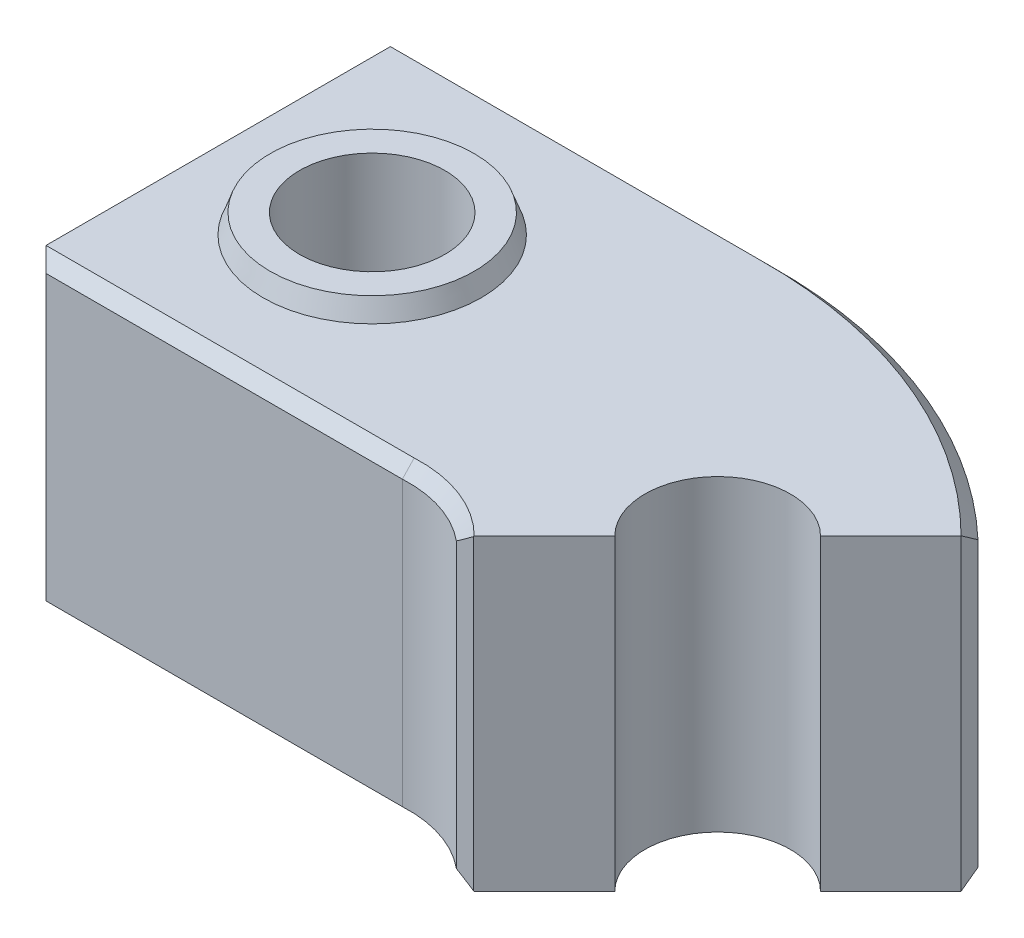
ISO-10303-21;
HEADER;
FILE_DESCRIPTION(('STEP AP214'),'2;1');
FILE_NAME('part.step','',(''),(''),'','','');
FILE_SCHEMA(('AUTOMOTIVE_DESIGN { 1 0 10303 214 1 1 1 1 }'));
ENDSEC;
DATA;
#1=APPLICATION_CONTEXT('core data for automotive mechanical design processes');
#2=APPLICATION_PROTOCOL_DEFINITION('international standard','automotive_design',2000,#1);
#3=PRODUCT_CONTEXT('',#1,'mechanical');
#4=PRODUCT('Part','Part','',(#3));
#5=PRODUCT_RELATED_PRODUCT_CATEGORY('part','',(#4));
#6=PRODUCT_DEFINITION_FORMATION('','',#4);
#7=PRODUCT_DEFINITION_CONTEXT('part definition',#1,'design');
#8=PRODUCT_DEFINITION('design','',#6,#7);
#9=PRODUCT_DEFINITION_SHAPE('','',#8);
#10=(LENGTH_UNIT() NAMED_UNIT(*) SI_UNIT(.MILLI.,.METRE.));
#11=(NAMED_UNIT(*) PLANE_ANGLE_UNIT() SI_UNIT($,.RADIAN.));
#12=(NAMED_UNIT(*) SI_UNIT($,.STERADIAN.) SOLID_ANGLE_UNIT());
#13=UNCERTAINTY_MEASURE_WITH_UNIT(LENGTH_MEASURE(1.E-05),#10,'distance_accuracy_value','');
#14=(GEOMETRIC_REPRESENTATION_CONTEXT(3) GLOBAL_UNCERTAINTY_ASSIGNED_CONTEXT((#13)) GLOBAL_UNIT_ASSIGNED_CONTEXT((#10,
#11,#12)) REPRESENTATION_CONTEXT('',''));
#15=CARTESIAN_POINT('',(0.,0.,0.));
#16=DIRECTION('',(0.,0.,1.));
#17=DIRECTION('',(1.,0.,0.));
#18=AXIS2_PLACEMENT_3D('',#15,#16,#17);
#19=CARTESIAN_POINT('',(-91.1181961206965,-213.,-123.982861888397));
#20=DIRECTION('',(0.,1.,0.));
#21=DIRECTION('',(0.,0.,1.));
#22=AXIS2_PLACEMENT_3D('',#19,#20,#21);
#23=CYLINDRICAL_SURFACE('',#22,30.);
#24=CARTESIAN_POINT('',(-91.1181961206965,8.,-123.982861888397));
#25=DIRECTION('',(0.,1.,0.));
#26=DIRECTION('',(0.,0.,1.));
#27=AXIS2_PLACEMENT_3D('',#24,#25,#26);
#28=CIRCLE('',#27,30.);
#29=CARTESIAN_POINT('',(-91.1181961206965,8.,-93.9828618883967));
#30=VERTEX_POINT('',#29);
#31=EDGE_CURVE('E474',#30,#30,#28,.T.);
#32=ORIENTED_EDGE('',*,*,#31,.T.);
#33=EDGE_LOOP('',(#32));
#34=FACE_BOUND('',#33,.T.);
#35=CARTESIAN_POINT('',(-91.1181961206965,-117.,-123.982861888397));
#36=DIRECTION('',(0.,-1.,0.));
#37=DIRECTION('',(0.,0.,-1.));
#38=AXIS2_PLACEMENT_3D('',#35,#36,#37);
#39=CIRCLE('',#38,30.);
#40=CARTESIAN_POINT('',(-91.1181961206965,-117.,-153.982861888397));
#41=VERTEX_POINT('',#40);
#42=EDGE_CURVE('E472',#41,#41,#39,.F.);
#43=ORIENTED_EDGE('',*,*,#42,.F.);
#44=EDGE_LOOP('',(#43));
#45=FACE_BOUND('',#44,.T.);
#46=ADVANCED_FACE('F35',(#34,#45),#23,.F.);
#47=CARTESIAN_POINT('',(0.,0.,0.));
#48=DIRECTION('',(0.,1.,0.));
#49=DIRECTION('',(0.,0.,1.));
#50=AXIS2_PLACEMENT_3D('',#47,#48,#49);
#51=PLANE('',#50);
#52=DIRECTION('',(-0.707106781186546,0.,0.707106781186549));
#53=VECTOR('',#52,1.);
#54=CARTESIAN_POINT('',(33.9411254969542,0.,-33.9411254969543));
#55=LINE('',#54,#53);
#56=CARTESIAN_POINT('',(137.840487520902,0.,-137.840487520902));
#57=VERTEX_POINT('',#56);
#58=CARTESIAN_POINT('',(108.894444302728,0.,-108.894444302728));
#59=VERTEX_POINT('',#58);
#60=EDGE_CURVE('E149',#57,#59,#55,.T.);
#61=ORIENTED_EDGE('',*,*,#60,.F.);
#62=DIRECTION('',(0.0128215667490054,0.,0.999917800334658));
#63=VECTOR('',#62,1.);
#64=CARTESIAN_POINT('',(139.585013305818,0.,-1.78984568997807));
#65=LINE('',#64,#63);
#66=CARTESIAN_POINT('',(137.839310000962,0.,-137.932318977311));
#67=VERTEX_POINT('',#66);
#68=EDGE_CURVE('E205',#57,#67,#65,.F.);
#69=ORIENTED_EDGE('',*,*,#68,.T.);
#70=CARTESIAN_POINT('',(0.,0.,0.));
#71=DIRECTION('',(0.,1.,0.));
#72=DIRECTION('',(0.,0.,1.));
#73=AXIS2_PLACEMENT_3D('',#70,#71,#72);
#74=CIRCLE('',#73,195.);
#75=CARTESIAN_POINT('',(-2.58526010498195,0.,-194.982861888397));
#76=VERTEX_POINT('',#75);
#77=EDGE_CURVE('E201',#67,#76,#74,.T.);
#78=ORIENTED_EDGE('',*,*,#77,.T.);
#79=DIRECTION('',(-1.,0.,0.));
#80=VECTOR('',#79,1.);
#81=CARTESIAN_POINT('',(-154.618196120696,0.,-194.982861888397));
#82=LINE('',#81,#80);
#83=CARTESIAN_POINT('',(-154.618196120696,0.,-194.982861888397));
#84=VERTEX_POINT('',#83);
#85=EDGE_CURVE('E203',#76,#84,#82,.T.);
#86=ORIENTED_EDGE('',*,*,#85,.T.);
#87=DIRECTION('',(0.,0.,-1.));
#88=VECTOR('',#87,1.);
#89=CARTESIAN_POINT('',(-154.618196120696,0.,-47.928541069738));
#90=LINE('',#89,#88);
#91=CARTESIAN_POINT('',(-154.618196120696,0.,-52.928541069738));
#92=VERTEX_POINT('',#91);
#93=EDGE_CURVE('E184',#92,#84,#90,.T.);
#94=ORIENTED_EDGE('',*,*,#93,.F.);
#95=DIRECTION('',(1.,0.,0.));
#96=VECTOR('',#95,1.);
#97=CARTESIAN_POINT('',(-2.61819612069647,0.,-52.928541069738));
#98=LINE('',#97,#96);
#99=CARTESIAN_POINT('',(-2.75127974387426,0.,-52.928541069738));
#100=VERTEX_POINT('',#99);
#101=EDGE_CURVE('E199',#92,#100,#98,.T.);
#102=ORIENTED_EDGE('',*,*,#101,.T.);
#103=CARTESIAN_POINT('',(0.,0.,0.));
#104=DIRECTION('',(0.,1.,0.));
#105=DIRECTION('',(0.,0.,1.));
#106=AXIS2_PLACEMENT_3D('',#103,#104,#105);
#107=CIRCLE('',#106,52.9999999999999);
#108=CARTESIAN_POINT('',(37.4766594028869,0.,-37.476659402887));
#109=VERTEX_POINT('',#108);
#110=EDGE_CURVE('E197',#100,#109,#107,.F.);
#111=ORIENTED_EDGE('',*,*,#110,.T.);
#112=CARTESIAN_POINT('',(66.4680374315353,0.,-66.4680374315355));
#113=VERTEX_POINT('',#112);
#114=EDGE_CURVE('E159',#113,#109,#55,.T.);
#115=ORIENTED_EDGE('',*,*,#114,.F.);
#116=CARTESIAN_POINT('',(87.6812408671317,0.,-87.681240867132));
#117=DIRECTION('',(0.,1.,0.));
#118=DIRECTION('',(0.,0.,1.));
#119=AXIS2_PLACEMENT_3D('',#116,#117,#118);
#120=CIRCLE('',#119,30.);
#121=EDGE_CURVE('E164',#59,#113,#120,.T.);
#122=ORIENTED_EDGE('',*,*,#121,.F.);
#123=EDGE_LOOP('',(#61,#69,#78,#86,#94,#102,#111,#115,#122));
#124=FACE_BOUND('',#123,.T.);
#125=CARTESIAN_POINT('',(-91.1181961206965,0.,-123.982861888397));
#126=DIRECTION('',(0.,1.,0.));
#127=DIRECTION('',(0.,0.,1.));
#128=AXIS2_PLACEMENT_3D('',#125,#126,#127);
#129=CIRCLE('',#128,45.);
#130=CARTESIAN_POINT('',(-91.1181961206965,0.,-78.9828618883967));
#131=VERTEX_POINT('',#130);
#132=EDGE_CURVE('E462',#131,#131,#129,.T.);
#133=ORIENTED_EDGE('',*,*,#132,.F.);
#134=EDGE_LOOP('',(#133));
#135=FACE_BOUND('',#134,.T.);
#136=ADVANCED_FACE('F172',(#124,#135),#51,.T.);
#137=CARTESIAN_POINT('',(33.9411254969542,-127.,-33.9411254969543));
#138=DIRECTION('',(-0.707106781186549,0.,-0.707106781186546));
#139=DIRECTION('',(-0.707106781186546,0.,0.707106781186549));
#140=AXIS2_PLACEMENT_3D('',#137,#138,#139);
#141=PLANE('',#140);
#142=DIRECTION('',(0.,-1.,0.));
#143=VECTOR('',#142,1.);
#144=CARTESIAN_POINT('',(37.3095162123551,-127.,-37.3095162123553));
#145=LINE('',#144,#143);
#146=CARTESIAN_POINT('',(37.3095162123551,-0.236376166908331,-37.3095162123553));
#147=VERTEX_POINT('',#146);
#148=CARTESIAN_POINT('',(37.3095162123551,-126.763623833092,-37.3095162123553));
#149=VERTEX_POINT('',#148);
#150=EDGE_CURVE('E243',#147,#149,#145,.T.);
#151=ORIENTED_EDGE('',*,*,#150,.T.);
#152=DIRECTION('',(0.499999999999997,-0.707106781186551,-0.499999999999999));
#153=VECTOR('',#152,1.);
#154=CARTESIAN_POINT('',(0.,-73.9999999999996,0.));
#155=LINE('',#154,#153);
#156=CARTESIAN_POINT('',(37.4766594028869,-127.,-37.476659402887));
#157=VERTEX_POINT('',#156);
#158=EDGE_CURVE('E246',#149,#157,#155,.T.);
#159=ORIENTED_EDGE('',*,*,#158,.T.);
#160=DIRECTION('',(-0.707106781186546,0.,0.707106781186549));
#161=VECTOR('',#160,1.);
#162=CARTESIAN_POINT('',(33.9411254969542,-127.,-33.9411254969543));
#163=LINE('',#162,#161);
#164=CARTESIAN_POINT('',(66.4680374315353,-127.,-66.4680374315355));
#165=VERTEX_POINT('',#164);
#166=EDGE_CURVE('E158',#165,#157,#163,.T.);
#167=ORIENTED_EDGE('',*,*,#166,.F.);
#168=DIRECTION('',(0.,1.,0.));
#169=VECTOR('',#168,1.);
#170=CARTESIAN_POINT('',(66.4680374315353,-127.,-66.4680374315355));
#171=LINE('',#170,#169);
#172=EDGE_CURVE('E168',#165,#113,#171,.T.);
#173=ORIENTED_EDGE('',*,*,#172,.T.);
#174=ORIENTED_EDGE('',*,*,#114,.T.);
#175=DIRECTION('',(-0.499999999999997,-0.707106781186551,0.499999999999999));
#176=VECTOR('',#175,1.);
#177=CARTESIAN_POINT('',(0.,-53.0000000000004,0.));
#178=LINE('',#177,#176);
#179=EDGE_CURVE('E241',#109,#147,#178,.T.);
#180=ORIENTED_EDGE('',*,*,#179,.T.);
#181=EDGE_LOOP('',(#151,#159,#167,#173,#174,#180));
#182=FACE_BOUND('',#181,.T.);
#183=ADVANCED_FACE('F411',(#182),#141,.F.);
#184=CARTESIAN_POINT('',(0.,-127.,0.));
#185=DIRECTION('',(0.,1.,0.));
#186=DIRECTION('',(0.,0.,1.));
#187=AXIS2_PLACEMENT_3D('',#184,#185,#186);
#188=CYLINDRICAL_SURFACE('',#187,48.);
#189=DIRECTION('',(0.,1.,0.));
#190=VECTOR('',#189,1.);
#191=CARTESIAN_POINT('',(-2.61819612069647,-127.,-47.928541069738));
#192=LINE('',#191,#190);
#193=CARTESIAN_POINT('',(-2.61819612069647,-122.,-47.928541069738));
#194=VERTEX_POINT('',#193);
#195=CARTESIAN_POINT('',(-2.61819612069647,-5.00000000000002,-47.928541069738));
#196=VERTEX_POINT('',#195);
#197=EDGE_CURVE('E169',#194,#196,#192,.T.);
#198=ORIENTED_EDGE('',*,*,#197,.F.);
#199=CARTESIAN_POINT('',(0.,-122.,0.));
#200=DIRECTION('',(0.,1.,0.));
#201=DIRECTION('',(0.,0.,1.));
#202=AXIS2_PLACEMENT_3D('',#199,#200,#201);
#203=CIRCLE('',#202,48.);
#204=CARTESIAN_POINT('',(30.5877575605335,-122.,-36.9917435033552));
#205=VERTEX_POINT('',#204);
#206=EDGE_CURVE('E239',#194,#205,#203,.F.);
#207=ORIENTED_EDGE('',*,*,#206,.T.);
#208=DIRECTION('',(0.,1.,0.));
#209=VECTOR('',#208,1.);
#210=CARTESIAN_POINT('',(30.5877575605335,-127.,-36.9917435033552));
#211=LINE('',#210,#209);
#212=CARTESIAN_POINT('',(30.5877575605335,-5.00000000000002,-36.9917435033552));
#213=VERTEX_POINT('',#212);
#214=EDGE_CURVE('E236',#205,#213,#211,.T.);
#215=ORIENTED_EDGE('',*,*,#214,.T.);
#216=CARTESIAN_POINT('',(0.,-5.00000000000002,0.));
#217=DIRECTION('',(0.,1.,0.));
#218=DIRECTION('',(0.,0.,1.));
#219=AXIS2_PLACEMENT_3D('',#216,#217,#218);
#220=CIRCLE('',#219,48.);
#221=EDGE_CURVE('E234',#213,#196,#220,.T.);
#222=ORIENTED_EDGE('',*,*,#221,.T.);
#223=EDGE_LOOP('',(#198,#207,#215,#222));
#224=FACE_BOUND('',#223,.T.);
#225=ADVANCED_FACE('F436',(#224),#188,.F.);
#226=CARTESIAN_POINT('',(0.,-127.,0.));
#227=DIRECTION('',(0.,1.,0.));
#228=DIRECTION('',(0.,0.,1.));
#229=AXIS2_PLACEMENT_3D('',#226,#227,#228);
#230=CYLINDRICAL_SURFACE('',#229,200.);
#231=DIRECTION('',(0.,1.,0.));
#232=VECTOR('',#231,1.);
#233=CARTESIAN_POINT('',(137.748670374327,-127.,-145.001047617267));
#234=LINE('',#233,#232);
#235=CARTESIAN_POINT('',(137.748670374327,-5.00000000000014,-145.001047617267));
#236=VERTEX_POINT('',#235);
#237=CARTESIAN_POINT('',(137.748670374327,-122.,-145.001047617267));
#238=VERTEX_POINT('',#237);
#239=EDGE_CURVE('E209',#236,#238,#234,.F.);
#240=ORIENTED_EDGE('',*,*,#239,.T.);
#241=CARTESIAN_POINT('',(0.,-122.,0.));
#242=DIRECTION('',(0.,1.,0.));
#243=DIRECTION('',(0.,0.,1.));
#244=AXIS2_PLACEMENT_3D('',#241,#242,#243);
#245=CIRCLE('',#244,200.);
#246=CARTESIAN_POINT('',(-2.61819612069639,-122.,-199.982861888397));
#247=VERTEX_POINT('',#246);
#248=EDGE_CURVE('E212',#238,#247,#245,.T.);
#249=ORIENTED_EDGE('',*,*,#248,.T.);
#250=DIRECTION('',(0.,1.,0.));
#251=VECTOR('',#250,1.);
#252=CARTESIAN_POINT('',(-2.61819612069639,-127.,-199.982861888397));
#253=LINE('',#252,#251);
#254=CARTESIAN_POINT('',(-2.61819612069639,-5.00000000000014,-199.982861888397));
#255=VERTEX_POINT('',#254);
#256=EDGE_CURVE('E191',#247,#255,#253,.T.);
#257=ORIENTED_EDGE('',*,*,#256,.T.);
#258=CARTESIAN_POINT('',(0.,-5.00000000000014,0.));
#259=DIRECTION('',(0.,1.,0.));
#260=DIRECTION('',(0.,0.,1.));
#261=AXIS2_PLACEMENT_3D('',#258,#259,#260);
#262=CIRCLE('',#261,200.);
#263=EDGE_CURVE('E207',#255,#236,#262,.F.);
#264=ORIENTED_EDGE('',*,*,#263,.T.);
#265=EDGE_LOOP('',(#240,#249,#257,#264));
#266=FACE_BOUND('',#265,.T.);
#267=ADVANCED_FACE('F432',(#266),#230,.T.);
#268=CARTESIAN_POINT('',(0.,-127.,0.));
#269=DIRECTION('',(0.,1.,0.));
#270=DIRECTION('',(0.,0.,1.));
#271=AXIS2_PLACEMENT_3D('',#268,#269,#270);
#272=PLANE('',#271);
#273=CARTESIAN_POINT('',(-91.1181961206965,-127.,-123.982861888397));
#274=DIRECTION('',(0.,-1.,0.));
#275=DIRECTION('',(0.,0.,-1.));
#276=AXIS2_PLACEMENT_3D('',#273,#274,#275);
#277=CIRCLE('',#276,46.);
#278=CARTESIAN_POINT('',(-91.1181961206965,-127.,-169.982861888397));
#279=VERTEX_POINT('',#278);
#280=EDGE_CURVE('E475',#279,#279,#277,.T.);
#281=ORIENTED_EDGE('',*,*,#280,.F.);
#282=EDGE_LOOP('',(#281));
#283=FACE_BOUND('',#282,.T.);
#284=CARTESIAN_POINT('',(0.,-127.,0.));
#285=DIRECTION('',(0.,1.,0.));
#286=DIRECTION('',(0.,0.,1.));
#287=AXIS2_PLACEMENT_3D('',#284,#285,#286);
#288=CIRCLE('',#287,195.);
#289=CARTESIAN_POINT('',(-2.58526010498195,-127.,-194.982861888397));
#290=VERTEX_POINT('',#289);
#291=CARTESIAN_POINT('',(137.839310000962,-127.,-137.932318977311));
#292=VERTEX_POINT('',#291);
#293=EDGE_CURVE('E220',#290,#292,#288,.F.);
#294=ORIENTED_EDGE('',*,*,#293,.T.);
#295=DIRECTION('',(-0.0128215667490054,0.,-0.999917800334658));
#296=VECTOR('',#295,1.);
#297=CARTESIAN_POINT('',(137.840487520902,-127.,-137.840487520902));
#298=LINE('',#297,#296);
#299=CARTESIAN_POINT('',(137.840487520902,-127.,-137.840487520902));
#300=VERTEX_POINT('',#299);
#301=EDGE_CURVE('E222',#292,#300,#298,.F.);
#302=ORIENTED_EDGE('',*,*,#301,.T.);
#303=CARTESIAN_POINT('',(108.894444302728,-127.,-108.894444302728));
#304=VERTEX_POINT('',#303);
#305=EDGE_CURVE('E183',#300,#304,#163,.T.);
#306=ORIENTED_EDGE('',*,*,#305,.T.);
#307=CARTESIAN_POINT('',(87.6812408671317,-127.,-87.681240867132));
#308=DIRECTION('',(0.,1.,0.));
#309=DIRECTION('',(0.,0.,1.));
#310=AXIS2_PLACEMENT_3D('',#307,#308,#309);
#311=CIRCLE('',#310,30.);
#312=EDGE_CURVE('E167',#304,#165,#311,.T.);
#313=ORIENTED_EDGE('',*,*,#312,.T.);
#314=ORIENTED_EDGE('',*,*,#166,.T.);
#315=CARTESIAN_POINT('',(0.,-127.,0.));
#316=DIRECTION('',(0.,1.,0.));
#317=DIRECTION('',(0.,0.,1.));
#318=AXIS2_PLACEMENT_3D('',#315,#316,#317);
#319=CIRCLE('',#318,52.9999999999999);
#320=CARTESIAN_POINT('',(-2.75127974387359,-127.,-52.9285410697381));
#321=VERTEX_POINT('',#320);
#322=EDGE_CURVE('E216',#157,#321,#319,.T.);
#323=ORIENTED_EDGE('',*,*,#322,.T.);
#324=DIRECTION('',(-1.,0.,0.));
#325=VECTOR('',#324,1.);
#326=CARTESIAN_POINT('',(0.,-127.,-52.9285410697381));
#327=LINE('',#326,#325);
#328=CARTESIAN_POINT('',(-154.618196120696,-127.,-52.928541069738));
#329=VERTEX_POINT('',#328);
#330=EDGE_CURVE('E214',#321,#329,#327,.T.);
#331=ORIENTED_EDGE('',*,*,#330,.T.);
#332=DIRECTION('',(0.,0.,1.));
#333=VECTOR('',#332,1.);
#334=CARTESIAN_POINT('',(-154.618196120696,-127.,-199.982861888397));
#335=LINE('',#334,#333);
#336=CARTESIAN_POINT('',(-154.618196120696,-127.,-194.982861888397));
#337=VERTEX_POINT('',#336);
#338=EDGE_CURVE('E188',#337,#329,#335,.T.);
#339=ORIENTED_EDGE('',*,*,#338,.F.);
#340=DIRECTION('',(1.,0.,0.));
#341=VECTOR('',#340,1.);
#342=CARTESIAN_POINT('',(0.,-127.,-194.982861888397));
#343=LINE('',#342,#341);
#344=EDGE_CURVE('E218',#337,#290,#343,.T.);
#345=ORIENTED_EDGE('',*,*,#344,.T.);
#346=EDGE_LOOP('',(#294,#302,#306,#313,#314,#323,#331,#339,#345));
#347=FACE_BOUND('',#346,.T.);
#348=ADVANCED_FACE('F430',(#283,#347),#272,.F.);
#349=CARTESIAN_POINT('',(-154.618196120696,-127.,-47.928541069738));
#350=DIRECTION('',(0.,0.,-1.));
#351=DIRECTION('',(-1.,0.,0.));
#352=AXIS2_PLACEMENT_3D('',#349,#350,#351);
#353=PLANE('',#352);
#354=DIRECTION('',(0.,-1.,0.));
#355=VECTOR('',#354,1.);
#356=CARTESIAN_POINT('',(-149.618196120696,-127.,-47.928541069738));
#357=LINE('',#356,#355);
#358=CARTESIAN_POINT('',(-149.618196120696,-5.00000000000002,-47.928541069738));
#359=VERTEX_POINT('',#358);
#360=CARTESIAN_POINT('',(-149.618196120696,-122.,-47.928541069738));
#361=VERTEX_POINT('',#360);
#362=EDGE_CURVE('E51',#359,#361,#357,.T.);
#363=ORIENTED_EDGE('',*,*,#362,.T.);
#364=DIRECTION('',(1.,0.,0.));
#365=VECTOR('',#364,1.);
#366=CARTESIAN_POINT('',(-154.618196120696,-122.,-47.928541069738));
#367=LINE('',#366,#365);
#368=EDGE_CURVE('E250',#361,#194,#367,.T.);
#369=ORIENTED_EDGE('',*,*,#368,.T.);
#370=ORIENTED_EDGE('',*,*,#197,.T.);
#371=DIRECTION('',(-1.,0.,0.));
#372=VECTOR('',#371,1.);
#373=CARTESIAN_POINT('',(-154.618196120696,-5.00000000000002,-47.928541069738));
#374=LINE('',#373,#372);
#375=EDGE_CURVE('E56',#196,#359,#374,.T.);
#376=ORIENTED_EDGE('',*,*,#375,.T.);
#377=EDGE_LOOP('',(#363,#369,#370,#376));
#378=FACE_BOUND('',#377,.T.);
#379=ADVANCED_FACE('F426',(#378),#353,.F.);
#380=CARTESIAN_POINT('',(-154.618196120696,0.,-199.982861888397));
#381=DIRECTION('',(0.,0.,1.));
#382=DIRECTION('',(1.,0.,0.));
#383=AXIS2_PLACEMENT_3D('',#380,#381,#382);
#384=PLANE('',#383);
#385=ORIENTED_EDGE('',*,*,#256,.F.);
#386=DIRECTION('',(-1.,0.,0.));
#387=VECTOR('',#386,1.);
#388=CARTESIAN_POINT('',(-154.618196120696,-122.,-199.982861888397));
#389=LINE('',#388,#387);
#390=CARTESIAN_POINT('',(-149.618196120696,-122.,-199.982861888397));
#391=VERTEX_POINT('',#390);
#392=EDGE_CURVE('E228',#247,#391,#389,.T.);
#393=ORIENTED_EDGE('',*,*,#392,.T.);
#394=DIRECTION('',(0.,1.,0.));
#395=VECTOR('',#394,1.);
#396=CARTESIAN_POINT('',(-149.618196120696,0.,-199.982861888397));
#397=LINE('',#396,#395);
#398=CARTESIAN_POINT('',(-149.618196120696,-5.00000000000014,-199.982861888397));
#399=VERTEX_POINT('',#398);
#400=EDGE_CURVE('E226',#391,#399,#397,.T.);
#401=ORIENTED_EDGE('',*,*,#400,.T.);
#402=DIRECTION('',(1.,0.,0.));
#403=VECTOR('',#402,1.);
#404=CARTESIAN_POINT('',(-2.61819612069639,-5.00000000000014,-199.982861888397));
#405=LINE('',#404,#403);
#406=EDGE_CURVE('E224',#399,#255,#405,.T.);
#407=ORIENTED_EDGE('',*,*,#406,.T.);
#408=EDGE_LOOP('',(#385,#393,#401,#407));
#409=FACE_BOUND('',#408,.T.);
#410=ADVANCED_FACE('F422',(#409),#384,.F.);
#411=CARTESIAN_POINT('',(-154.618196120696,0.,0.));
#412=DIRECTION('',(-1.,0.,0.));
#413=DIRECTION('',(0.,0.,1.));
#414=AXIS2_PLACEMENT_3D('',#411,#412,#413);
#415=PLANE('',#414);
#416=ORIENTED_EDGE('',*,*,#93,.T.);
#417=DIRECTION('',(0.,-1.,0.));
#418=VECTOR('',#417,1.);
#419=CARTESIAN_POINT('',(-154.618196120696,-127.,-194.982861888397));
#420=LINE('',#419,#418);
#421=EDGE_CURVE('E232',#84,#337,#420,.T.);
#422=ORIENTED_EDGE('',*,*,#421,.T.);
#423=ORIENTED_EDGE('',*,*,#338,.T.);
#424=DIRECTION('',(0.,1.,0.));
#425=VECTOR('',#424,1.);
#426=CARTESIAN_POINT('',(-154.618196120696,0.,-52.928541069738));
#427=LINE('',#426,#425);
#428=EDGE_CURVE('E230',#329,#92,#427,.T.);
#429=ORIENTED_EDGE('',*,*,#428,.T.);
#430=EDGE_LOOP('',(#416,#422,#423,#429));
#431=FACE_BOUND('',#430,.T.);
#432=ADVANCED_FACE('F419',(#431),#415,.T.);
#433=ORIENTED_EDGE('',*,*,#305,.F.);
#434=DIRECTION('',(0.,1.,0.));
#435=VECTOR('',#434,1.);
#436=CARTESIAN_POINT('',(137.840487520902,0.,-137.840487520902));
#437=LINE('',#436,#435);
#438=EDGE_CURVE('E155',#300,#57,#437,.T.);
#439=ORIENTED_EDGE('',*,*,#438,.T.);
#440=ORIENTED_EDGE('',*,*,#60,.T.);
#441=DIRECTION('',(0.,1.,0.));
#442=VECTOR('',#441,1.);
#443=CARTESIAN_POINT('',(108.894444302728,-127.,-108.894444302728));
#444=LINE('',#443,#442);
#445=EDGE_CURVE('E153',#59,#304,#444,.F.);
#446=ORIENTED_EDGE('',*,*,#445,.T.);
#447=EDGE_LOOP('',(#433,#439,#440,#446));
#448=FACE_BOUND('',#447,.T.);
#449=ADVANCED_FACE('F152',(#448),#141,.F.);
#450=CARTESIAN_POINT('',(87.6812408671317,-127.,-87.681240867132));
#451=DIRECTION('',(0.,1.,0.));
#452=DIRECTION('',(0.,0.,1.));
#453=AXIS2_PLACEMENT_3D('',#450,#451,#452);
#454=CYLINDRICAL_SURFACE('',#453,30.);
#455=ORIENTED_EDGE('',*,*,#312,.F.);
#456=ORIENTED_EDGE('',*,*,#445,.F.);
#457=ORIENTED_EDGE('',*,*,#121,.T.);
#458=ORIENTED_EDGE('',*,*,#172,.F.);
#459=EDGE_LOOP('',(#455,#456,#457,#458));
#460=FACE_BOUND('',#459,.T.);
#461=ADVANCED_FACE('F163',(#460),#454,.F.);
#462=CARTESIAN_POINT('',(-154.618196120696,0.,-194.982861888397));
#463=DIRECTION('',(-0.707106781186546,0.,-0.707106781186549));
#464=DIRECTION('',(0.,1.,0.));
#465=AXIS2_PLACEMENT_3D('',#462,#463,#464);
#466=PLANE('',#465);
#467=DIRECTION('',(-0.577350269189627,0.577350269189627,0.577350269189624));
#468=VECTOR('',#467,1.);
#469=CARTESIAN_POINT('',(-151.284862787363,-3.33333333333342,-198.31619522173));
#470=LINE('',#469,#468);
#471=EDGE_CURVE('E179',#399,#84,#470,.T.);
#472=ORIENTED_EDGE('',*,*,#471,.F.);
#473=ORIENTED_EDGE('',*,*,#400,.F.);
#474=DIRECTION('',(0.577350269189627,0.577350269189627,-0.577350269189624));
#475=VECTOR('',#474,1.);
#476=CARTESIAN_POINT('',(-112.284862787363,-84.6666666666665,-237.31619522173));
#477=LINE('',#476,#475);
#478=EDGE_CURVE('E175',#337,#391,#477,.T.);
#479=ORIENTED_EDGE('',*,*,#478,.F.);
#480=ORIENTED_EDGE('',*,*,#421,.F.);
#481=EDGE_LOOP('',(#472,#473,#479,#480));
#482=FACE_BOUND('',#481,.T.);
#483=ADVANCED_FACE('F316',(#482),#466,.T.);
#484=CARTESIAN_POINT('',(0.,-127.,-194.982861888397));
#485=DIRECTION('',(0.,0.707106781186546,0.707106781186549));
#486=DIRECTION('',(1.,0.,0.));
#487=AXIS2_PLACEMENT_3D('',#484,#485,#486);
#488=PLANE('',#487);
#489=ORIENTED_EDGE('',*,*,#478,.T.);
#490=ORIENTED_EDGE('',*,*,#392,.F.);
#491=CARTESIAN_POINT('',(-2.61819612069639,-122.,-199.982861888397));
#492=CARTESIAN_POINT('',(-2.61274152952234,-122.833333447766,-199.14952844063));
#493=CARTESIAN_POINT('',(-2.60726956595903,-123.666666838315,-198.316195050081));
#494=CARTESIAN_POINT('',(-2.59629089405389,-125.333333504982,-196.649528383415));
#495=CARTESIAN_POINT('',(-2.59078418571205,-126.1666667811,-195.816195107297));
#496=CARTESIAN_POINT('',(-2.58526010498097,-127.,-194.982861888397));
#497=B_SPLINE_CURVE_WITH_KNOTS('',3,(#491,#492,#493,#494,#495,#496),.UNSPECIFIED.,.F.,.F.,(4,2,
4),(0.,3.53557225890391,7.07114451782728),.UNSPECIFIED.);
#498=EDGE_CURVE('E296',#290,#247,#497,.F.);
#499=ORIENTED_EDGE('',*,*,#498,.F.);
#500=ORIENTED_EDGE('',*,*,#344,.F.);
#501=EDGE_LOOP('',(#489,#490,#499,#500));
#502=FACE_BOUND('',#501,.T.);
#503=ADVANCED_FACE('F309',(#502),#488,.F.);
#504=CARTESIAN_POINT('',(-154.618196120696,-5.00000000000014,-199.982861888397));
#505=DIRECTION('',(0.,0.707106781186546,-0.707106781186549));
#506=DIRECTION('',(-1.,0.,0.));
#507=AXIS2_PLACEMENT_3D('',#504,#505,#506);
#508=PLANE('',#507);
#509=ORIENTED_EDGE('',*,*,#471,.T.);
#510=ORIENTED_EDGE('',*,*,#85,.F.);
#511=CARTESIAN_POINT('',(-2.61819612069639,-5.00000000000014,-199.982861888397));
#512=CARTESIAN_POINT('',(-2.6127415295223,-4.16666655223362,-199.14952844063));
#513=CARTESIAN_POINT('',(-2.60726956595897,-3.33333316168483,-198.316195050081));
#514=CARTESIAN_POINT('',(-2.59629089405379,-1.66666649501811,-196.649528383415));
#515=CARTESIAN_POINT('',(-2.59078418571195,-0.833333218900191,-195.816195107297));
#516=CARTESIAN_POINT('',(-2.58526010498086,0.,-194.982861888397));
#517=B_SPLINE_CURVE_WITH_KNOTS('',3,(#511,#512,#513,#514,#515,#516),.UNSPECIFIED.,.F.,.F.,(4,2,
4),(0.,3.53557225890392,7.07114451782729),.UNSPECIFIED.);
#518=EDGE_CURVE('E303',#255,#76,#517,.T.);
#519=ORIENTED_EDGE('',*,*,#518,.F.);
#520=ORIENTED_EDGE('',*,*,#406,.F.);
#521=EDGE_LOOP('',(#509,#510,#519,#520));
#522=FACE_BOUND('',#521,.T.);
#523=ADVANCED_FACE('F290',(#522),#508,.T.);
#524=CARTESIAN_POINT('',(0.,-122.,0.));
#525=DIRECTION('',(0.,1.,0.));
#526=DIRECTION('',(0.,0.,1.));
#527=AXIS2_PLACEMENT_3D('',#524,#525,#526);
#528=CONICAL_SURFACE('',#527,200.,0.785398163397443);
#529=ORIENTED_EDGE('',*,*,#498,.T.);
#530=ORIENTED_EDGE('',*,*,#248,.F.);
#531=CARTESIAN_POINT('',(137.748670374327,-122.,-145.001047617267));
#532=CARTESIAN_POINT('',(137.756192304157,-122.420117264034,-144.414433541362));
#533=CARTESIAN_POINT('',(137.763721864013,-122.839403797578,-143.827224421319));
#534=CARTESIAN_POINT('',(137.778796507152,-123.676264782753,-142.651595552898));
#535=CARTESIAN_POINT('',(137.786341590297,-124.093839249565,-142.063175815324));
#536=CARTESIAN_POINT('',(137.801447679616,-124.927233089284,-140.885094548137));
#537=CARTESIAN_POINT('',(137.809008685795,-125.3430524616,-140.295433018105));
#538=CARTESIAN_POINT('',(137.824147027533,-126.172890248044,-139.114836475726));
#539=CARTESIAN_POINT('',(137.831724363237,-126.586908646135,-138.523901452108));
#540=CARTESIAN_POINT('',(137.839310000962,-127.,-137.932318977311));
#541=B_SPLINE_CURVE_WITH_KNOTS('',3,(#531,#532,#533,#534,#535,#536,#537,#538,#539,#540),
.UNSPECIFIED.,.F.,.F.,(4,2,2,2,4),(0.,2.16472593567516,4.32943263468397,6.49414006412013,
8.65886673037112),.UNSPECIFIED.);
#542=EDGE_CURVE('E261',#292,#238,#541,.F.);
#543=ORIENTED_EDGE('',*,*,#542,.F.);
#544=ORIENTED_EDGE('',*,*,#293,.F.);
#545=EDGE_LOOP('',(#529,#530,#543,#544));
#546=FACE_BOUND('',#545,.T.);
#547=ADVANCED_FACE('F282',(#546),#528,.T.);
#548=CARTESIAN_POINT('',(0.,0.,0.));
#549=DIRECTION('',(0.,-1.,0.));
#550=DIRECTION('',(0.,0.,-1.));
#551=AXIS2_PLACEMENT_3D('',#548,#549,#550);
#552=CONICAL_SURFACE('',#551,195.,0.785398163397443);
#553=ORIENTED_EDGE('',*,*,#518,.T.);
#554=ORIENTED_EDGE('',*,*,#77,.F.);
#555=CARTESIAN_POINT('',(137.839310000962,0.,-137.932318977311));
#556=CARTESIAN_POINT('',(137.831724363237,-0.413091353864877,-138.523901452108));
#557=CARTESIAN_POINT('',(137.824147027533,-0.827109751955599,-139.114836475726));
#558=CARTESIAN_POINT('',(137.809008685795,-1.65694753839961,-140.295433018105));
#559=CARTESIAN_POINT('',(137.801447679616,-2.07276691071572,-140.885094548137));
#560=CARTESIAN_POINT('',(137.786341590297,-2.90616075043535,-142.063175815324));
#561=CARTESIAN_POINT('',(137.778796507152,-3.32373521724661,-142.651595552898));
#562=CARTESIAN_POINT('',(137.763721864013,-4.16059620242158,-143.827224421319));
#563=CARTESIAN_POINT('',(137.756192304157,-4.57988273596646,-144.414433541362));
#564=CARTESIAN_POINT('',(137.748670374327,-5.00000000000014,-145.001047617267));
#565=B_SPLINE_CURVE_WITH_KNOTS('',3,(#555,#556,#557,#558,#559,#560,#561,#562,#563,#564),
.UNSPECIFIED.,.F.,.F.,(4,2,2,2,4),(0.,2.16472666625094,4.32943409568714,6.49414079469594,
8.6588667303711),.UNSPECIFIED.);
#566=EDGE_CURVE('E252',#236,#67,#565,.F.);
#567=ORIENTED_EDGE('',*,*,#566,.F.);
#568=ORIENTED_EDGE('',*,*,#263,.F.);
#569=EDGE_LOOP('',(#553,#554,#567,#568));
#570=FACE_BOUND('',#569,.T.);
#571=ADVANCED_FACE('F270',(#570),#552,.T.);
#572=CARTESIAN_POINT('',(137.840487520902,-127.,-137.840487520902));
#573=DIRECTION('',(-0.999917800334658,0.,0.0128215667490054));
#574=DIRECTION('',(0.,1.,0.));
#575=AXIS2_PLACEMENT_3D('',#572,#573,#574);
#576=PLANE('',#575);
#577=ORIENTED_EDGE('',*,*,#542,.T.);
#578=ORIENTED_EDGE('',*,*,#239,.F.);
#579=ORIENTED_EDGE('',*,*,#566,.T.);
#580=ORIENTED_EDGE('',*,*,#68,.F.);
#581=ORIENTED_EDGE('',*,*,#438,.F.);
#582=ORIENTED_EDGE('',*,*,#301,.F.);
#583=EDGE_LOOP('',(#577,#578,#579,#580,#581,#582));
#584=FACE_BOUND('',#583,.T.);
#585=ADVANCED_FACE('F274',(#584),#576,.F.);
#586=CARTESIAN_POINT('',(-154.618196120696,0.,-52.928541069738));
#587=DIRECTION('',(-0.707106781186544,0.,0.707106781186551));
#588=DIRECTION('',(0.,-1.,0.));
#589=AXIS2_PLACEMENT_3D('',#586,#587,#588);
#590=PLANE('',#589);
#591=DIRECTION('',(0.577350269189628,-0.577350269189627,0.577350269189622));
#592=VECTOR('',#591,1.);
#593=CARTESIAN_POINT('',(-103.078797413797,-51.5393987068992,-1.38914236283929));
#594=LINE('',#593,#592);
#595=EDGE_CURVE('E455',#92,#359,#594,.T.);
#596=ORIENTED_EDGE('',*,*,#595,.F.);
#597=ORIENTED_EDGE('',*,*,#428,.F.);
#598=DIRECTION('',(-0.577350269189632,-0.57735026918962,-0.577350269189625));
#599=VECTOR('',#598,1.);
#600=CARTESIAN_POINT('',(-112.284862787363,-84.6666666666674,-10.5952077364051));
#601=LINE('',#600,#599);
#602=EDGE_CURVE('E262',#361,#329,#601,.T.);
#603=ORIENTED_EDGE('',*,*,#602,.F.);
#604=ORIENTED_EDGE('',*,*,#362,.F.);
#605=EDGE_LOOP('',(#596,#597,#603,#604));
#606=FACE_BOUND('',#605,.T.);
#607=ADVANCED_FACE('F280',(#606),#590,.T.);
#608=CARTESIAN_POINT('',(-154.618196120696,-122.,-47.928541069738));
#609=DIRECTION('',(0.,0.70710678118655,-0.707106781186545));
#610=DIRECTION('',(1.,0.,0.));
#611=AXIS2_PLACEMENT_3D('',#608,#609,#610);
#612=PLANE('',#611);
#613=ORIENTED_EDGE('',*,*,#602,.T.);
#614=ORIENTED_EDGE('',*,*,#330,.F.);
#615=CARTESIAN_POINT('',(-2.75127974387359,-127.,-52.928541069738));
#616=CARTESIAN_POINT('',(-2.72964861216315,-126.166659356335,-52.0952004260735));
#617=CARTESIAN_POINT('',(-2.70774274440721,-125.333322368958,-51.2618634386958));
#618=CARTESIAN_POINT('',(-2.66338153668498,-123.666655702291,-49.5951967720291));
#619=CARTESIAN_POINT('',(-2.64092619671573,-122.833326023002,-48.7618670927401));
#620=CARTESIAN_POINT('',(-2.61819612069803,-122.,-47.928541069738));
#621=B_SPLINE_CURVE_WITH_KNOTS('',3,(#615,#616,#617,#618,#619,#620),.UNSPECIFIED.,.F.,.F.,(4,2,
4),(0.,3.53616012433691,7.07232026770539),.UNSPECIFIED.);
#622=EDGE_CURVE('E354',#194,#321,#621,.F.);
#623=ORIENTED_EDGE('',*,*,#622,.F.);
#624=ORIENTED_EDGE('',*,*,#368,.F.);
#625=EDGE_LOOP('',(#613,#614,#623,#624));
#626=FACE_BOUND('',#625,.T.);
#627=ADVANCED_FACE('F374',(#626),#612,.F.);
#628=CARTESIAN_POINT('',(0.,0.,-52.928541069738));
#629=DIRECTION('',(0.,0.707106781186545,0.70710678118655));
#630=DIRECTION('',(-1.,0.,0.));
#631=AXIS2_PLACEMENT_3D('',#628,#629,#630);
#632=PLANE('',#631);
#633=ORIENTED_EDGE('',*,*,#595,.T.);
#634=ORIENTED_EDGE('',*,*,#375,.F.);
#635=CARTESIAN_POINT('',(-2.75127974387426,0.,-52.928541069738));
#636=CARTESIAN_POINT('',(-2.72964861216357,-0.833340643664533,-52.0952004260735));
#637=CARTESIAN_POINT('',(-2.70774274440738,-1.66667763104223,-51.2618634386958));
#638=CARTESIAN_POINT('',(-2.66338153668465,-3.33334429770895,-49.5951967720291));
#639=CARTESIAN_POINT('',(-2.64092619671515,-4.16667397699793,-48.7618670927401));
#640=CARTESIAN_POINT('',(-2.61819612069719,-5.00000000000003,-47.928541069738));
#641=B_SPLINE_CURVE_WITH_KNOTS('',3,(#635,#636,#637,#638,#639,#640),.UNSPECIFIED.,.F.,.F.,(4,2,
4),(0.,3.53616012433693,7.07232026770542),.UNSPECIFIED.);
#642=EDGE_CURVE('E346',#100,#196,#641,.T.);
#643=ORIENTED_EDGE('',*,*,#642,.F.);
#644=ORIENTED_EDGE('',*,*,#101,.F.);
#645=EDGE_LOOP('',(#633,#634,#643,#644));
#646=FACE_BOUND('',#645,.T.);
#647=ADVANCED_FACE('F367',(#646),#632,.T.);
#648=CARTESIAN_POINT('',(0.,-122.,0.));
#649=DIRECTION('',(0.,-1.,0.));
#650=DIRECTION('',(0.,0.,-1.));
#651=AXIS2_PLACEMENT_3D('',#648,#649,#650);
#652=CONICAL_SURFACE('',#651,48.,0.785398163397443);
#653=ORIENTED_EDGE('',*,*,#322,.F.);
#654=ORIENTED_EDGE('',*,*,#158,.F.);
#655=CARTESIAN_POINT('',(37.3095162123551,-126.763623833092,-37.3095162123553));
#656=CARTESIAN_POINT('',(36.7576908676021,-126.354992440297,-37.2834285403962));
#657=CARTESIAN_POINT('',(36.203998158897,-125.948877500468,-37.2572525883704));
#658=CARTESIAN_POINT('',(35.0926212935277,-125.142305992403,-37.2047119876851));
#659=CARTESIAN_POINT('',(34.5349376374877,-124.741848732582,-37.1783473626927));
#660=CARTESIAN_POINT('',(33.4151764366651,-123.947110041196,-37.1254103905921));
#661=CARTESIAN_POINT('',(32.853098815263,-123.552828717686,-37.0988380398617));
#662=CARTESIAN_POINT('',(31.724120894696,-122.771100363894,-37.0454653451841));
#663=CARTESIAN_POINT('',(31.1572200090776,-122.383654182811,-37.0186649735122));
#664=CARTESIAN_POINT('',(30.5877575605335,-122.,-36.9917435033552));
#665=B_SPLINE_CURVE_WITH_KNOTS('',3,(#655,#656,#657,#658,#659,#660,#661,#662,#663,#664),
.UNSPECIFIED.,.F.,.F.,(4,2,2,2,4),(0.,2.0614440097917,4.12263381312774,6.18385963886773,
8.24533977332511),.UNSPECIFIED.);
#666=EDGE_CURVE('E355',#205,#149,#665,.F.);
#667=ORIENTED_EDGE('',*,*,#666,.F.);
#668=ORIENTED_EDGE('',*,*,#206,.F.);
#669=ORIENTED_EDGE('',*,*,#622,.T.);
#670=EDGE_LOOP('',(#653,#654,#667,#668,#669));
#671=FACE_BOUND('',#670,.T.);
#672=ADVANCED_FACE('F333',(#671),#652,.F.);
#673=CARTESIAN_POINT('',(0.,0.,0.));
#674=DIRECTION('',(0.,1.,0.));
#675=DIRECTION('',(0.,0.,1.));
#676=AXIS2_PLACEMENT_3D('',#673,#674,#675);
#677=CONICAL_SURFACE('',#676,52.9999999999999,0.785398163397443);
#678=ORIENTED_EDGE('',*,*,#642,.T.);
#679=ORIENTED_EDGE('',*,*,#221,.F.);
#680=CARTESIAN_POINT('',(30.5877575605335,-5.00000000000002,-36.9917435033552));
#681=CARTESIAN_POINT('',(31.1572200090776,-4.61634581718884,-37.0186649735122));
#682=CARTESIAN_POINT('',(31.724120894696,-4.22889963610575,-37.0454653451841));
#683=CARTESIAN_POINT('',(32.853098815263,-3.44717128231351,-37.0988380398617));
#684=CARTESIAN_POINT('',(33.4151764366651,-3.05288995880356,-37.1254103905921));
#685=CARTESIAN_POINT('',(34.5349376374877,-2.25815126741818,-37.1783473626927));
#686=CARTESIAN_POINT('',(35.0926212935277,-1.857694007597,-37.2047119876851));
#687=CARTESIAN_POINT('',(36.203998158897,-1.05112249953173,-37.2572525883704));
#688=CARTESIAN_POINT('',(36.7576908676021,-0.645007559702552,-37.2834285403962));
#689=CARTESIAN_POINT('',(37.3095162123551,-0.236376166908326,-37.3095162123553));
#690=B_SPLINE_CURVE_WITH_KNOTS('',3,(#680,#681,#682,#683,#684,#685,#686,#687,#688,#689),
.UNSPECIFIED.,.F.,.F.,(4,2,2,2,4),(0.,2.06148013445739,4.12270596019738,6.18389576353343,
8.24533977332512),.UNSPECIFIED.);
#691=EDGE_CURVE('E339',#147,#213,#690,.F.);
#692=ORIENTED_EDGE('',*,*,#691,.F.);
#693=ORIENTED_EDGE('',*,*,#179,.F.);
#694=ORIENTED_EDGE('',*,*,#110,.F.);
#695=EDGE_LOOP('',(#678,#679,#692,#693,#694));
#696=FACE_BOUND('',#695,.T.);
#697=ADVANCED_FACE('F324',(#696),#677,.F.);
#698=CARTESIAN_POINT('',(30.5877575605335,-127.,-36.9917435033552));
#699=DIRECTION('',(-0.0472224929324737,0.,-0.998884395794249));
#700=DIRECTION('',(0.,1.,0.));
#701=AXIS2_PLACEMENT_3D('',#698,#699,#700);
#702=PLANE('',#701);
#703=ORIENTED_EDGE('',*,*,#666,.T.);
#704=ORIENTED_EDGE('',*,*,#150,.F.);
#705=ORIENTED_EDGE('',*,*,#691,.T.);
#706=ORIENTED_EDGE('',*,*,#214,.F.);
#707=EDGE_LOOP('',(#703,#704,#705,#706));
#708=FACE_BOUND('',#707,.T.);
#709=ADVANCED_FACE('F332',(#708),#702,.F.);
#710=CARTESIAN_POINT('',(-91.1181961206965,8.,-123.982861888397));
#711=DIRECTION('',(0.,1.,0.));
#712=DIRECTION('',(0.,0.,1.));
#713=AXIS2_PLACEMENT_3D('',#710,#711,#712);
#714=PLANE('',#713);
#715=CARTESIAN_POINT('',(-91.1181961206965,8.,-123.982861888397));
#716=DIRECTION('',(0.,1.,0.));
#717=DIRECTION('',(0.,0.,1.));
#718=AXIS2_PLACEMENT_3D('',#715,#716,#717);
#719=CIRCLE('',#718,42.0882381258704);
#720=CARTESIAN_POINT('',(-91.1181961206965,8.,-81.8946237625262));
#721=VERTEX_POINT('',#720);
#722=EDGE_CURVE('E44',#721,#721,#719,.T.);
#723=ORIENTED_EDGE('',*,*,#722,.T.);
#724=EDGE_LOOP('',(#723));
#725=FACE_BOUND('',#724,.T.);
#726=ORIENTED_EDGE('',*,*,#31,.F.);
#727=EDGE_LOOP('',(#726));
#728=FACE_BOUND('',#727,.T.);
#729=ADVANCED_FACE('F393',(#725,#728),#714,.T.);
#730=CARTESIAN_POINT('',(-91.1181961206965,8.,-123.982861888397));
#731=DIRECTION('',(0.,-1.,0.));
#732=DIRECTION('',(0.,0.,-1.));
#733=AXIS2_PLACEMENT_3D('',#730,#731,#732);
#734=CONICAL_SURFACE('',#733,42.0882381258704,0.349065850398863);
#735=ORIENTED_EDGE('',*,*,#132,.T.);
#736=EDGE_LOOP('',(#735));
#737=FACE_BOUND('',#736,.T.);
#738=ORIENTED_EDGE('',*,*,#722,.F.);
#739=EDGE_LOOP('',(#738));
#740=FACE_BOUND('',#739,.T.);
#741=ADVANCED_FACE('F388',(#737,#740),#734,.T.);
#742=CARTESIAN_POINT('',(-91.1181961206965,-117.,-123.982861888397));
#743=DIRECTION('',(0.,-1.,0.));
#744=DIRECTION('',(0.,0.,-1.));
#745=AXIS2_PLACEMENT_3D('',#742,#743,#744);
#746=PLANE('',#745);
#747=CARTESIAN_POINT('',(-91.1181961206965,-117.,-123.982861888397));
#748=DIRECTION('',(0.,-1.,0.));
#749=DIRECTION('',(0.,0.,-1.));
#750=AXIS2_PLACEMENT_3D('',#747,#748,#749);
#751=CIRCLE('',#750,42.360297657338);
#752=CARTESIAN_POINT('',(-91.1181961206965,-117.,-166.343159545735));
#753=VERTEX_POINT('',#752);
#754=EDGE_CURVE('E11',#753,#753,#751,.T.);
#755=ORIENTED_EDGE('',*,*,#754,.T.);
#756=EDGE_LOOP('',(#755));
#757=FACE_BOUND('',#756,.T.);
#758=ORIENTED_EDGE('',*,*,#42,.T.);
#759=EDGE_LOOP('',(#758));
#760=FACE_BOUND('',#759,.T.);
#761=ADVANCED_FACE('F392',(#757,#760),#746,.T.);
#762=CARTESIAN_POINT('',(-91.1181961206965,-117.,-123.982861888397));
#763=DIRECTION('',(0.,-1.,0.));
#764=DIRECTION('',(0.,0.,-1.));
#765=AXIS2_PLACEMENT_3D('',#762,#763,#764);
#766=CONICAL_SURFACE('',#765,42.360297657338,0.349065850398872);
#767=ORIENTED_EDGE('',*,*,#280,.T.);
#768=EDGE_LOOP('',(#767));
#769=FACE_BOUND('',#768,.T.);
#770=ORIENTED_EDGE('',*,*,#754,.F.);
#771=EDGE_LOOP('',(#770));
#772=FACE_BOUND('',#771,.T.);
#773=ADVANCED_FACE('F38',(#769,#772),#766,.F.);
#774=CLOSED_SHELL('',(#46,#136,#183,#225,#267,#348,#379,#410,#432,#449,#461,#483,#503,#523,#547,
#571,#585,#607,#627,#647,#672,#697,#709,#729,#741,#761,#773));
#775=MANIFOLD_SOLID_BREP('B2',#774);
#776=ADVANCED_BREP_SHAPE_REPRESENTATION('',(#18,#775),#14);
#777=SHAPE_DEFINITION_REPRESENTATION(#9,#776);
ENDSEC;
END-ISO-10303-21;
